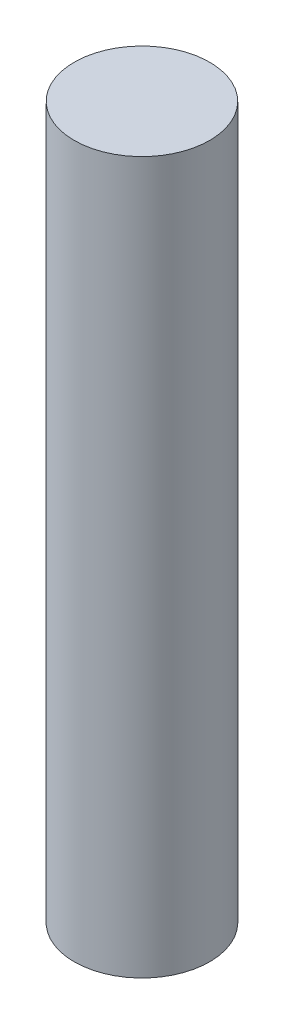
ISO-10303-21;
HEADER;
FILE_DESCRIPTION(('STEP AP214'),'2;1');
FILE_NAME('part.step','',(''),(''),'','','');
FILE_SCHEMA(('AUTOMOTIVE_DESIGN { 1 0 10303 214 1 1 1 1 }'));
ENDSEC;
DATA;
#1=APPLICATION_CONTEXT('core data for automotive mechanical design processes');
#2=APPLICATION_PROTOCOL_DEFINITION('international standard','automotive_design',2000,#1);
#3=PRODUCT_CONTEXT('',#1,'mechanical');
#4=PRODUCT('Part','Part','',(#3));
#5=PRODUCT_RELATED_PRODUCT_CATEGORY('part','',(#4));
#6=PRODUCT_DEFINITION_FORMATION('','',#4);
#7=PRODUCT_DEFINITION_CONTEXT('part definition',#1,'design');
#8=PRODUCT_DEFINITION('design','',#6,#7);
#9=PRODUCT_DEFINITION_SHAPE('','',#8);
#10=(LENGTH_UNIT() NAMED_UNIT(*) SI_UNIT(.MILLI.,.METRE.));
#11=(NAMED_UNIT(*) PLANE_ANGLE_UNIT() SI_UNIT($,.RADIAN.));
#12=(NAMED_UNIT(*) SI_UNIT($,.STERADIAN.) SOLID_ANGLE_UNIT());
#13=UNCERTAINTY_MEASURE_WITH_UNIT(LENGTH_MEASURE(1.E-05),#10,'distance_accuracy_value','');
#14=(GEOMETRIC_REPRESENTATION_CONTEXT(3) GLOBAL_UNCERTAINTY_ASSIGNED_CONTEXT((#13)) GLOBAL_UNIT_ASSIGNED_CONTEXT((#10,
#11,#12)) REPRESENTATION_CONTEXT('',''));
#15=CARTESIAN_POINT('',(0.,0.,0.));
#16=DIRECTION('',(0.,0.,1.));
#17=DIRECTION('',(1.,0.,0.));
#18=AXIS2_PLACEMENT_3D('',#15,#16,#17);
#19=CARTESIAN_POINT('',(0.,21.,0.));
#20=DIRECTION('',(0.,-1.,0.));
#21=DIRECTION('',(0.,0.,-1.));
#22=AXIS2_PLACEMENT_3D('',#19,#20,#21);
#23=CYLINDRICAL_SURFACE('',#22,2.);
#24=CARTESIAN_POINT('',(0.,21.,0.));
#25=DIRECTION('',(0.,1.,0.));
#26=DIRECTION('',(0.,0.,1.));
#27=AXIS2_PLACEMENT_3D('',#24,#25,#26);
#28=CIRCLE('',#27,2.);
#29=CARTESIAN_POINT('',(0.,21.,2.));
#30=VERTEX_POINT('',#29);
#31=EDGE_CURVE('E10',#30,#30,#28,.T.);
#32=ORIENTED_EDGE('',*,*,#31,.F.);
#33=EDGE_LOOP('',(#32));
#34=FACE_BOUND('',#33,.T.);
#35=CARTESIAN_POINT('',(0.,0.,0.));
#36=DIRECTION('',(0.,1.,0.));
#37=DIRECTION('',(0.,0.,1.));
#38=AXIS2_PLACEMENT_3D('',#35,#36,#37);
#39=CIRCLE('',#38,2.);
#40=CARTESIAN_POINT('',(0.,0.,2.));
#41=VERTEX_POINT('',#40);
#42=EDGE_CURVE('E35',#41,#41,#39,.T.);
#43=ORIENTED_EDGE('',*,*,#42,.T.);
#44=EDGE_LOOP('',(#43));
#45=FACE_BOUND('',#44,.T.);
#46=ADVANCED_FACE('F32',(#34,#45),#23,.T.);
#47=CARTESIAN_POINT('',(0.,21.,0.));
#48=DIRECTION('',(0.,1.,0.));
#49=DIRECTION('',(0.,0.,1.));
#50=AXIS2_PLACEMENT_3D('',#47,#48,#49);
#51=PLANE('',#50);
#52=ORIENTED_EDGE('',*,*,#31,.T.);
#53=EDGE_LOOP('',(#52));
#54=FACE_BOUND('',#53,.T.);
#55=ADVANCED_FACE('F47',(#54),#51,.T.);
#56=CARTESIAN_POINT('',(0.,0.,0.));
#57=DIRECTION('',(0.,1.,0.));
#58=DIRECTION('',(0.,0.,1.));
#59=AXIS2_PLACEMENT_3D('',#56,#57,#58);
#60=PLANE('',#59);
#61=ORIENTED_EDGE('',*,*,#42,.F.);
#62=EDGE_LOOP('',(#61));
#63=FACE_BOUND('',#62,.T.);
#64=ADVANCED_FACE('F45',(#63),#60,.F.);
#65=CLOSED_SHELL('',(#46,#55,#64));
#66=MANIFOLD_SOLID_BREP('B2',#65);
#67=ADVANCED_BREP_SHAPE_REPRESENTATION('',(#18,#66),#14);
#68=SHAPE_DEFINITION_REPRESENTATION(#9,#67);
ENDSEC;
END-ISO-10303-21;
